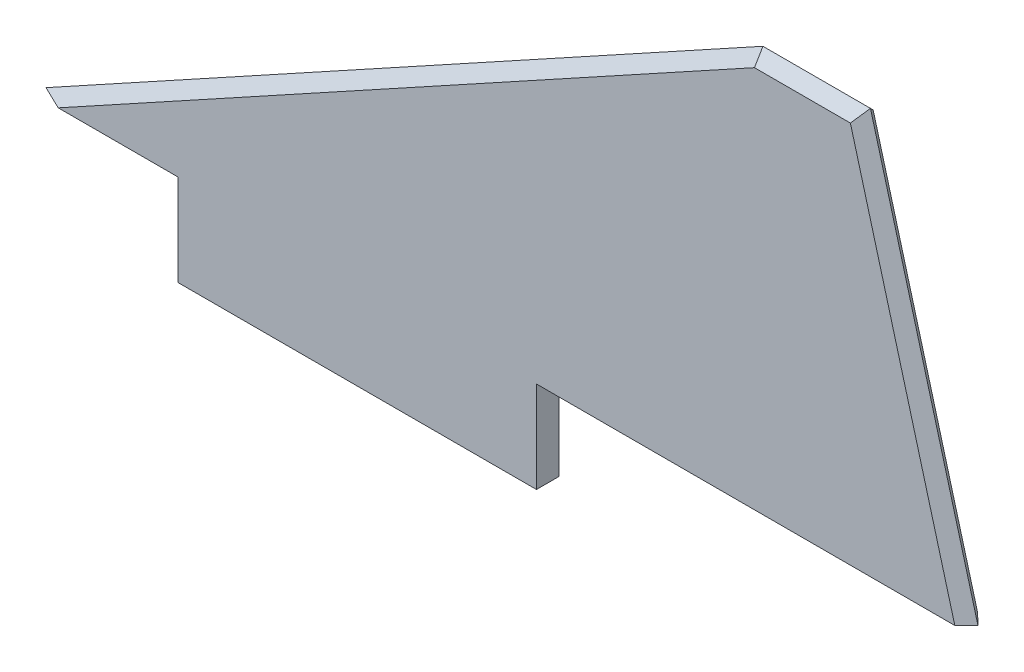
ISO-10303-21;
HEADER;
FILE_DESCRIPTION(('STEP AP214'),'2;1');
FILE_NAME('part.step','',(''),(''),'','','');
FILE_SCHEMA(('AUTOMOTIVE_DESIGN { 1 0 10303 214 1 1 1 1 }'));
ENDSEC;
DATA;
#1=APPLICATION_CONTEXT('core data for automotive mechanical design processes');
#2=APPLICATION_PROTOCOL_DEFINITION('international standard','automotive_design',2000,#1);
#3=PRODUCT_CONTEXT('',#1,'mechanical');
#4=PRODUCT('Part','Part','',(#3));
#5=PRODUCT_RELATED_PRODUCT_CATEGORY('part','',(#4));
#6=PRODUCT_DEFINITION_FORMATION('','',#4);
#7=PRODUCT_DEFINITION_CONTEXT('part definition',#1,'design');
#8=PRODUCT_DEFINITION('design','',#6,#7);
#9=PRODUCT_DEFINITION_SHAPE('','',#8);
#10=(LENGTH_UNIT() NAMED_UNIT(*) SI_UNIT(.MILLI.,.METRE.));
#11=(NAMED_UNIT(*) PLANE_ANGLE_UNIT() SI_UNIT($,.RADIAN.));
#12=(NAMED_UNIT(*) SI_UNIT($,.STERADIAN.) SOLID_ANGLE_UNIT());
#13=UNCERTAINTY_MEASURE_WITH_UNIT(LENGTH_MEASURE(1.E-05),#10,'distance_accuracy_value','');
#14=(GEOMETRIC_REPRESENTATION_CONTEXT(3) GLOBAL_UNCERTAINTY_ASSIGNED_CONTEXT((#13)) GLOBAL_UNIT_ASSIGNED_CONTEXT((#10,
#11,#12)) REPRESENTATION_CONTEXT('',''));
#15=CARTESIAN_POINT('',(0.,0.,0.));
#16=DIRECTION('',(0.,0.,1.));
#17=DIRECTION('',(1.,0.,0.));
#18=AXIS2_PLACEMENT_3D('',#15,#16,#17);
#19=CARTESIAN_POINT('',(0.,0.,3.175));
#20=DIRECTION('',(0.,1.,0.));
#21=DIRECTION('',(0.,0.,1.));
#22=AXIS2_PLACEMENT_3D('',#19,#20,#21);
#23=PLANE('',#22);
#24=DIRECTION('',(1.,0.,0.));
#25=VECTOR('',#24,1.);
#26=CARTESIAN_POINT('',(0.,0.,3.175));
#27=LINE('',#26,#25);
#28=CARTESIAN_POINT('',(3.2941237516709,0.,3.175));
#29=VERTEX_POINT('',#28);
#30=CARTESIAN_POINT('',(20.,0.,3.175));
#31=VERTEX_POINT('',#30);
#32=EDGE_CURVE('E175',#29,#31,#27,.T.);
#33=ORIENTED_EDGE('',*,*,#32,.F.);
#34=DIRECTION('',(0.900847645138056,0.,0.43413537088012));
#35=VECTOR('',#34,1.);
#36=CARTESIAN_POINT('',(1.24171019922797,0.,2.18590342679128));
#37=LINE('',#36,#35);
#38=CARTESIAN_POINT('',(0.,0.,1.58749999999996));
#39=VERTEX_POINT('',#38);
#40=EDGE_CURVE('E122',#29,#39,#37,.F.);
#41=ORIENTED_EDGE('',*,*,#40,.T.);
#42=DIRECTION('',(0.900847645138056,0.,-0.43413537088012));
#43=VECTOR('',#42,1.);
#44=CARTESIAN_POINT('',(81.152647975078,0.,-37.5214826528493));
#45=LINE('',#44,#43);
#46=CARTESIAN_POINT('',(3.29412375167085,0.,0.));
#47=VERTEX_POINT('',#46);
#48=EDGE_CURVE('E151',#39,#47,#45,.T.);
#49=ORIENTED_EDGE('',*,*,#48,.T.);
#50=DIRECTION('',(1.,0.,0.));
#51=VECTOR('',#50,1.);
#52=CARTESIAN_POINT('',(0.,0.,0.));
#53=LINE('',#52,#51);
#54=CARTESIAN_POINT('',(20.,0.,0.));
#55=VERTEX_POINT('',#54);
#56=EDGE_CURVE('E75',#47,#55,#53,.T.);
#57=ORIENTED_EDGE('',*,*,#56,.T.);
#58=DIRECTION('',(0.,0.,-1.));
#59=VECTOR('',#58,1.);
#60=CARTESIAN_POINT('',(20.,0.,3.175));
#61=LINE('',#60,#59);
#62=EDGE_CURVE('E184',#31,#55,#61,.T.);
#63=ORIENTED_EDGE('',*,*,#62,.F.);
#64=EDGE_LOOP('',(#33,#41,#49,#57,#63));
#65=FACE_BOUND('',#64,.T.);
#66=ADVANCED_FACE('F33',(#65),#23,.F.);
#67=CARTESIAN_POINT('',(20.,0.,3.175));
#68=DIRECTION('',(1.,0.,0.));
#69=DIRECTION('',(0.,0.,-1.));
#70=AXIS2_PLACEMENT_3D('',#67,#68,#69);
#71=PLANE('',#70);
#72=DIRECTION('',(0.,-1.,0.));
#73=VECTOR('',#72,1.);
#74=CARTESIAN_POINT('',(20.,0.,0.));
#75=LINE('',#74,#73);
#76=CARTESIAN_POINT('',(20.,-12.75,0.));
#77=VERTEX_POINT('',#76);
#78=EDGE_CURVE('E163',#55,#77,#75,.T.);
#79=ORIENTED_EDGE('',*,*,#78,.T.);
#80=DIRECTION('',(0.,0.,-1.));
#81=VECTOR('',#80,1.);
#82=CARTESIAN_POINT('',(20.,-12.75,3.175));
#83=LINE('',#82,#81);
#84=CARTESIAN_POINT('',(20.,-12.75,3.175));
#85=VERTEX_POINT('',#84);
#86=EDGE_CURVE('E181',#85,#77,#83,.T.);
#87=ORIENTED_EDGE('',*,*,#86,.F.);
#88=DIRECTION('',(0.,-1.,0.));
#89=VECTOR('',#88,1.);
#90=CARTESIAN_POINT('',(20.,0.,3.175));
#91=LINE('',#90,#89);
#92=EDGE_CURVE('E200',#31,#85,#91,.T.);
#93=ORIENTED_EDGE('',*,*,#92,.F.);
#94=ORIENTED_EDGE('',*,*,#62,.T.);
#95=EDGE_LOOP('',(#79,#87,#93,#94));
#96=FACE_BOUND('',#95,.T.);
#97=ADVANCED_FACE('F212',(#96),#71,.F.);
#98=CARTESIAN_POINT('',(20.,-12.75,3.175));
#99=DIRECTION('',(0.,1.,0.));
#100=DIRECTION('',(0.,0.,1.));
#101=AXIS2_PLACEMENT_3D('',#98,#99,#100);
#102=PLANE('',#101);
#103=DIRECTION('',(1.,0.,0.));
#104=VECTOR('',#103,1.);
#105=CARTESIAN_POINT('',(20.,-12.75,0.));
#106=LINE('',#105,#104);
#107=CARTESIAN_POINT('',(70.,-12.75,0.));
#108=VERTEX_POINT('',#107);
#109=EDGE_CURVE('E165',#77,#108,#106,.T.);
#110=ORIENTED_EDGE('',*,*,#109,.T.);
#111=DIRECTION('',(0.,0.,-1.));
#112=VECTOR('',#111,1.);
#113=CARTESIAN_POINT('',(70.,-12.75,3.175));
#114=LINE('',#113,#112);
#115=CARTESIAN_POINT('',(70.,-12.75,3.175));
#116=VERTEX_POINT('',#115);
#117=EDGE_CURVE('E178',#116,#108,#114,.T.);
#118=ORIENTED_EDGE('',*,*,#117,.F.);
#119=DIRECTION('',(1.,0.,0.));
#120=VECTOR('',#119,1.);
#121=CARTESIAN_POINT('',(20.,-12.75,3.175));
#122=LINE('',#121,#120);
#123=EDGE_CURVE('E199',#85,#116,#122,.T.);
#124=ORIENTED_EDGE('',*,*,#123,.F.);
#125=ORIENTED_EDGE('',*,*,#86,.T.);
#126=EDGE_LOOP('',(#110,#118,#124,#125));
#127=FACE_BOUND('',#126,.T.);
#128=ADVANCED_FACE('F216',(#127),#102,.F.);
#129=CARTESIAN_POINT('',(70.,-12.75,3.175));
#130=DIRECTION('',(-1.,0.,0.));
#131=DIRECTION('',(0.,0.,1.));
#132=AXIS2_PLACEMENT_3D('',#129,#130,#131);
#133=PLANE('',#132);
#134=DIRECTION('',(0.,1.,0.));
#135=VECTOR('',#134,1.);
#136=CARTESIAN_POINT('',(70.,-12.75,0.));
#137=LINE('',#136,#135);
#138=CARTESIAN_POINT('',(70.,0.,0.));
#139=VERTEX_POINT('',#138);
#140=EDGE_CURVE('E172',#108,#139,#137,.T.);
#141=ORIENTED_EDGE('',*,*,#140,.T.);
#142=DIRECTION('',(0.,0.,-1.));
#143=VECTOR('',#142,1.);
#144=CARTESIAN_POINT('',(70.,0.,3.175));
#145=LINE('',#144,#143);
#146=CARTESIAN_POINT('',(70.,0.,3.175));
#147=VERTEX_POINT('',#146);
#148=EDGE_CURVE('E176',#147,#139,#145,.T.);
#149=ORIENTED_EDGE('',*,*,#148,.F.);
#150=DIRECTION('',(0.,1.,0.));
#151=VECTOR('',#150,1.);
#152=CARTESIAN_POINT('',(70.,-12.75,3.175));
#153=LINE('',#152,#151);
#154=EDGE_CURVE('E197',#116,#147,#153,.T.);
#155=ORIENTED_EDGE('',*,*,#154,.F.);
#156=ORIENTED_EDGE('',*,*,#117,.T.);
#157=EDGE_LOOP('',(#141,#149,#155,#156));
#158=FACE_BOUND('',#157,.T.);
#159=ADVANCED_FACE('F219',(#158),#133,.F.);
#160=CARTESIAN_POINT('',(70.,0.,3.175));
#161=DIRECTION('',(0.,1.,0.));
#162=DIRECTION('',(-1.,0.,0.));
#163=AXIS2_PLACEMENT_3D('',#160,#161,#162);
#164=PLANE('',#163);
#165=DIRECTION('',(0.719672346872239,0.,0.694313843407578));
#166=VECTOR('',#165,1.);
#167=CARTESIAN_POINT('',(130.,0.,1.58749999999996));
#168=LINE('',#167,#166);
#169=CARTESIAN_POINT('',(128.354519556959,0.,0.));
#170=VERTEX_POINT('',#169);
#171=CARTESIAN_POINT('',(130.,0.,1.58749999999996));
#172=VERTEX_POINT('',#171);
#173=EDGE_CURVE('E113',#170,#172,#168,.T.);
#174=ORIENTED_EDGE('',*,*,#173,.T.);
#175=DIRECTION('',(0.719672346872233,0.,-0.694313843407585));
#176=VECTOR('',#175,1.);
#177=CARTESIAN_POINT('',(123.752166266072,0.,7.61518394760218));
#178=LINE('',#177,#176);
#179=CARTESIAN_POINT('',(128.354519556959,0.,3.175));
#180=VERTEX_POINT('',#179);
#181=EDGE_CURVE('E117',#172,#180,#178,.F.);
#182=ORIENTED_EDGE('',*,*,#181,.T.);
#183=DIRECTION('',(1.,0.,0.));
#184=VECTOR('',#183,1.);
#185=CARTESIAN_POINT('',(70.,0.,3.175));
#186=LINE('',#185,#184);
#187=EDGE_CURVE('E168',#147,#180,#186,.T.);
#188=ORIENTED_EDGE('',*,*,#187,.F.);
#189=ORIENTED_EDGE('',*,*,#148,.T.);
#190=DIRECTION('',(1.,0.,0.));
#191=VECTOR('',#190,1.);
#192=CARTESIAN_POINT('',(70.,0.,0.));
#193=LINE('',#192,#191);
#194=EDGE_CURVE('E121',#139,#170,#193,.T.);
#195=ORIENTED_EDGE('',*,*,#194,.T.);
#196=EDGE_LOOP('',(#174,#182,#188,#189,#195));
#197=FACE_BOUND('',#196,.T.);
#198=ADVANCED_FACE('F114',(#197),#164,.F.);
#199=CARTESIAN_POINT('',(0.,0.,3.175));
#200=DIRECTION('',(0.,0.,-1.));
#201=DIRECTION('',(-1.,0.,0.));
#202=AXIS2_PLACEMENT_3D('',#199,#200,#201);
#203=PLANE('',#202);
#204=DIRECTION('',(-1.,0.,0.));
#205=VECTOR('',#204,1.);
#206=CARTESIAN_POINT('',(0.,53.4125,3.175));
#207=LINE('',#206,#205);
#208=CARTESIAN_POINT('',(113.787474102414,53.4125,3.175));
#209=VERTEX_POINT('',#208);
#210=CARTESIAN_POINT('',(100.407760115307,53.4125,3.175));
#211=VERTEX_POINT('',#210);
#212=EDGE_CURVE('E161',#209,#211,#207,.T.);
#213=ORIENTED_EDGE('',*,*,#212,.T.);
#214=DIRECTION('',(-0.876215908676647,-0.481918749772156,0.));
#215=VECTOR('',#214,1.);
#216=CARTESIAN_POINT('',(0.7650460152633,-1.39099275502418,3.175));
#217=LINE('',#216,#215);
#218=EDGE_CURVE('E157',#211,#29,#217,.T.);
#219=ORIENTED_EDGE('',*,*,#218,.T.);
#220=ORIENTED_EDGE('',*,*,#32,.T.);
#221=ORIENTED_EDGE('',*,*,#92,.T.);
#222=ORIENTED_EDGE('',*,*,#123,.T.);
#223=ORIENTED_EDGE('',*,*,#154,.T.);
#224=ORIENTED_EDGE('',*,*,#187,.T.);
#225=DIRECTION('',(-0.263117405792109,0.964763821237732,0.));
#226=VECTOR('',#225,1.);
#227=CARTESIAN_POINT('',(119.468437433785,32.5823011183051,3.175));
#228=LINE('',#227,#226);
#229=EDGE_CURVE('E129',#180,#209,#228,.T.);
#230=ORIENTED_EDGE('',*,*,#229,.T.);
#231=EDGE_LOOP('',(#213,#219,#220,#221,#222,#223,#224,#230));
#232=FACE_BOUND('',#231,.T.);
#233=ADVANCED_FACE('F192',(#232),#203,.F.);
#234=CARTESIAN_POINT('',(0.,0.,0.));
#235=DIRECTION('',(0.,0.,-1.));
#236=DIRECTION('',(-1.,0.,0.));
#237=AXIS2_PLACEMENT_3D('',#234,#235,#236);
#238=PLANE('',#237);
#239=ORIENTED_EDGE('',*,*,#56,.F.);
#240=DIRECTION('',(0.876215908676647,0.481918749772156,0.));
#241=VECTOR('',#240,1.);
#242=CARTESIAN_POINT('',(100.765046015263,53.6090072449758,0.));
#243=LINE('',#242,#241);
#244=CARTESIAN_POINT('',(100.407760115307,53.4125,0.));
#245=VERTEX_POINT('',#244);
#246=EDGE_CURVE('E11',#47,#245,#243,.T.);
#247=ORIENTED_EDGE('',*,*,#246,.T.);
#248=DIRECTION('',(1.,0.,0.));
#249=VECTOR('',#248,1.);
#250=CARTESIAN_POINT('',(115.,53.4125,0.));
#251=LINE('',#250,#249);
#252=CARTESIAN_POINT('',(113.787474102414,53.4125,0.));
#253=VERTEX_POINT('',#252);
#254=EDGE_CURVE('E43',#245,#253,#251,.T.);
#255=ORIENTED_EDGE('',*,*,#254,.T.);
#256=DIRECTION('',(0.263117405792109,-0.964763821237732,0.));
#257=VECTOR('',#256,1.);
#258=CARTESIAN_POINT('',(128.468437433785,-0.417698881694962,0.));
#259=LINE('',#258,#257);
#260=EDGE_CURVE('E130',#253,#170,#259,.T.);
#261=ORIENTED_EDGE('',*,*,#260,.T.);
#262=ORIENTED_EDGE('',*,*,#194,.F.);
#263=ORIENTED_EDGE('',*,*,#140,.F.);
#264=ORIENTED_EDGE('',*,*,#109,.F.);
#265=ORIENTED_EDGE('',*,*,#78,.F.);
#266=EDGE_LOOP('',(#239,#247,#255,#261,#262,#263,#264,#265));
#267=FACE_BOUND('',#266,.T.);
#268=ADVANCED_FACE('F220',(#267),#238,.T.);
#269=CARTESIAN_POINT('',(130.,0.,1.58749999999996));
#270=DIRECTION('',(0.682191040240641,0.186052101883812,-0.707106781186553));
#271=DIRECTION('',(0.263117405792109,-0.964763821237732,0.));
#272=AXIS2_PLACEMENT_3D('',#269,#270,#271);
#273=PLANE('',#272);
#274=ORIENTED_EDGE('',*,*,#173,.F.);
#275=ORIENTED_EDGE('',*,*,#260,.F.);
#276=DIRECTION('',(0.475206967003291,0.622164905194569,0.622164905194568));
#277=VECTOR('',#276,1.);
#278=CARTESIAN_POINT('',(102.12618455579,38.1449521545338,-15.2675478454662));
#279=LINE('',#278,#277);
#280=CARTESIAN_POINT('',(115.,55.,1.58750000000001));
#281=VERTEX_POINT('',#280);
#282=EDGE_CURVE('E37',#281,#253,#279,.F.);
#283=ORIENTED_EDGE('',*,*,#282,.F.);
#284=DIRECTION('',(-0.263117405792109,0.964763821237732,0.));
#285=VECTOR('',#284,1.);
#286=CARTESIAN_POINT('',(115.,55.,1.58749999999996));
#287=LINE('',#286,#285);
#288=EDGE_CURVE('E124',#172,#281,#287,.T.);
#289=ORIENTED_EDGE('',*,*,#288,.F.);
#290=EDGE_LOOP('',(#274,#275,#283,#289));
#291=FACE_BOUND('',#290,.T.);
#292=ADVANCED_FACE('F35',(#291),#273,.T.);
#293=CARTESIAN_POINT('',(115.,55.,1.58749999999996));
#294=DIRECTION('',(0.,0.707106781186546,-0.707106781186549));
#295=DIRECTION('',(1.,0.,0.));
#296=AXIS2_PLACEMENT_3D('',#293,#294,#295);
#297=PLANE('',#296);
#298=ORIENTED_EDGE('',*,*,#282,.T.);
#299=ORIENTED_EDGE('',*,*,#254,.F.);
#300=DIRECTION('',(-0.178701598222412,0.695724708053681,0.695724708053678));
#301=VECTOR('',#300,1.);
#302=CARTESIAN_POINT('',(100.479013918109,53.1350932412198,-0.277406758780237));
#303=LINE('',#302,#301);
#304=CARTESIAN_POINT('',(100.,55.,1.58750000000001));
#305=VERTEX_POINT('',#304);
#306=EDGE_CURVE('E60',#305,#245,#303,.F.);
#307=ORIENTED_EDGE('',*,*,#306,.F.);
#308=DIRECTION('',(-1.,0.,0.));
#309=VECTOR('',#308,1.);
#310=CARTESIAN_POINT('',(100.,55.,1.58749999999996));
#311=LINE('',#310,#309);
#312=EDGE_CURVE('E145',#281,#305,#311,.T.);
#313=ORIENTED_EDGE('',*,*,#312,.F.);
#314=EDGE_LOOP('',(#298,#299,#307,#313));
#315=FACE_BOUND('',#314,.T.);
#316=ADVANCED_FACE('F162',(#315),#297,.T.);
#317=CARTESIAN_POINT('',(119.468437433785,32.5823011183051,3.175));
#318=DIRECTION('',(-0.682191040240647,-0.186052101883813,-0.707106781186546));
#319=DIRECTION('',(-0.263117405792109,0.964763821237732,0.));
#320=AXIS2_PLACEMENT_3D('',#317,#318,#319);
#321=PLANE('',#320);
#322=ORIENTED_EDGE('',*,*,#181,.F.);
#323=ORIENTED_EDGE('',*,*,#288,.T.);
#324=DIRECTION('',(-0.47520696700328,-0.622164905194577,0.622164905194569));
#325=VECTOR('',#324,1.);
#326=CARTESIAN_POINT('',(108.91176253752,47.0289727494263,9.55852725057366));
#327=LINE('',#326,#325);
#328=EDGE_CURVE('E142',#209,#281,#327,.F.);
#329=ORIENTED_EDGE('',*,*,#328,.F.);
#330=ORIENTED_EDGE('',*,*,#229,.F.);
#331=EDGE_LOOP('',(#322,#323,#329,#330));
#332=FACE_BOUND('',#331,.T.);
#333=ADVANCED_FACE('F128',(#332),#321,.F.);
#334=CARTESIAN_POINT('',(100.,55.,1.58749999999996));
#335=DIRECTION('',(-0.340768015944834,0.619578210808788,-0.707106781186549));
#336=DIRECTION('',(0.876215908676647,0.481918749772156,0.));
#337=AXIS2_PLACEMENT_3D('',#334,#335,#336);
#338=PLANE('',#337);
#339=ORIENTED_EDGE('',*,*,#246,.F.);
#340=ORIENTED_EDGE('',*,*,#48,.F.);
#341=DIRECTION('',(-0.876215908676647,-0.481918749772156,0.));
#342=VECTOR('',#341,1.);
#343=CARTESIAN_POINT('',(0.,0.,1.58749999999996));
#344=LINE('',#343,#342);
#345=EDGE_CURVE('E139',#305,#39,#344,.T.);
#346=ORIENTED_EDGE('',*,*,#345,.F.);
#347=ORIENTED_EDGE('',*,*,#306,.T.);
#348=EDGE_LOOP('',(#339,#340,#346,#347));
#349=FACE_BOUND('',#348,.T.);
#350=ADVANCED_FACE('F149',(#349),#338,.T.);
#351=CARTESIAN_POINT('',(0.,53.4125,3.175));
#352=DIRECTION('',(0.,-0.707106781186543,-0.707106781186552));
#353=DIRECTION('',(-1.,0.,0.));
#354=AXIS2_PLACEMENT_3D('',#351,#352,#353);
#355=PLANE('',#354);
#356=ORIENTED_EDGE('',*,*,#328,.T.);
#357=ORIENTED_EDGE('',*,*,#312,.T.);
#358=DIRECTION('',(0.1787015982224,-0.695724708053685,0.695724708053677));
#359=VECTOR('',#358,1.);
#360=CARTESIAN_POINT('',(97.2013124765511,65.8959073648672,-9.308407364867));
#361=LINE('',#360,#359);
#362=EDGE_CURVE('E136',#211,#305,#361,.F.);
#363=ORIENTED_EDGE('',*,*,#362,.F.);
#364=ORIENTED_EDGE('',*,*,#212,.F.);
#365=EDGE_LOOP('',(#356,#357,#363,#364));
#366=FACE_BOUND('',#365,.T.);
#367=ADVANCED_FACE('F160',(#366),#355,.F.);
#368=CARTESIAN_POINT('',(0.7650460152633,-1.39099275502418,3.175));
#369=DIRECTION('',(0.340768015944834,-0.619578210808788,-0.707106781186549));
#370=DIRECTION('',(-0.876215908676647,-0.481918749772156,0.));
#371=AXIS2_PLACEMENT_3D('',#368,#369,#370);
#372=PLANE('',#371);
#373=ORIENTED_EDGE('',*,*,#362,.T.);
#374=ORIENTED_EDGE('',*,*,#345,.T.);
#375=ORIENTED_EDGE('',*,*,#40,.F.);
#376=ORIENTED_EDGE('',*,*,#218,.F.);
#377=EDGE_LOOP('',(#373,#374,#375,#376));
#378=FACE_BOUND('',#377,.T.);
#379=ADVANCED_FACE('F155',(#378),#372,.F.);
#380=CLOSED_SHELL('',(#66,#97,#128,#159,#198,#233,#268,#292,#316,#333,#350,#367,#379));
#381=MANIFOLD_SOLID_BREP('B2',#380);
#382=ADVANCED_BREP_SHAPE_REPRESENTATION('',(#18,#381),#14);
#383=SHAPE_DEFINITION_REPRESENTATION(#9,#382);
ENDSEC;
END-ISO-10303-21;
